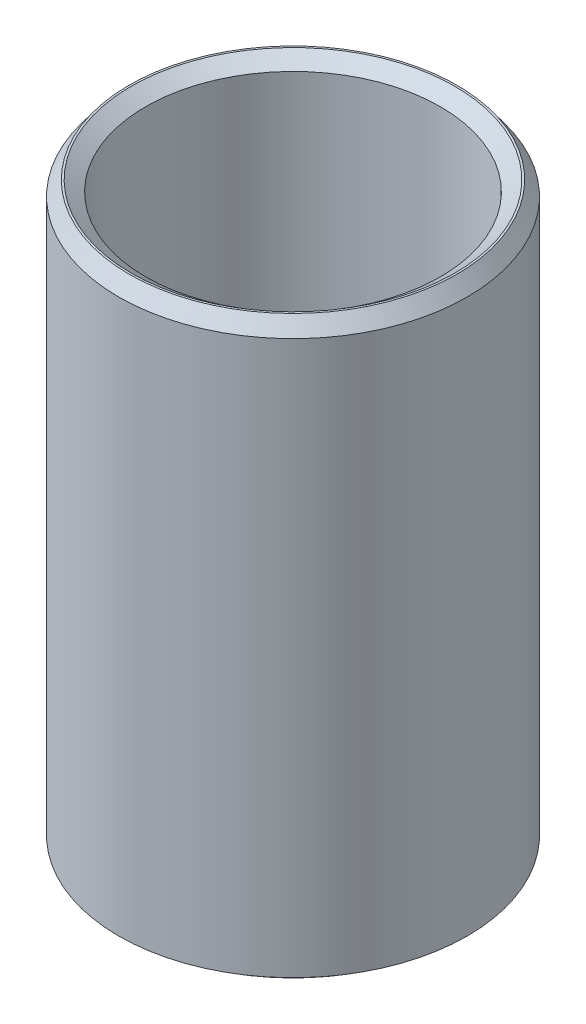
ISO-10303-21;
HEADER;
FILE_DESCRIPTION(('STEP AP214'),'2;1');
FILE_NAME('part.step','',(''),(''),'','','');
FILE_SCHEMA(('AUTOMOTIVE_DESIGN { 1 0 10303 214 1 1 1 1 }'));
ENDSEC;
DATA;
#1=APPLICATION_CONTEXT('core data for automotive mechanical design processes');
#2=APPLICATION_PROTOCOL_DEFINITION('international standard','automotive_design',2000,#1);
#3=PRODUCT_CONTEXT('',#1,'mechanical');
#4=PRODUCT('Part','Part','',(#3));
#5=PRODUCT_RELATED_PRODUCT_CATEGORY('part','',(#4));
#6=PRODUCT_DEFINITION_FORMATION('','',#4);
#7=PRODUCT_DEFINITION_CONTEXT('part definition',#1,'design');
#8=PRODUCT_DEFINITION('design','',#6,#7);
#9=PRODUCT_DEFINITION_SHAPE('','',#8);
#10=(LENGTH_UNIT() NAMED_UNIT(*) SI_UNIT(.MILLI.,.METRE.));
#11=(NAMED_UNIT(*) PLANE_ANGLE_UNIT() SI_UNIT($,.RADIAN.));
#12=(NAMED_UNIT(*) SI_UNIT($,.STERADIAN.) SOLID_ANGLE_UNIT());
#13=UNCERTAINTY_MEASURE_WITH_UNIT(LENGTH_MEASURE(1.E-05),#10,'distance_accuracy_value','');
#14=(GEOMETRIC_REPRESENTATION_CONTEXT(3) GLOBAL_UNCERTAINTY_ASSIGNED_CONTEXT((#13)) GLOBAL_UNIT_ASSIGNED_CONTEXT((#10,
#11,#12)) REPRESENTATION_CONTEXT('',''));
#15=CARTESIAN_POINT('',(0.,0.,0.));
#16=DIRECTION('',(0.,0.,1.));
#17=DIRECTION('',(1.,0.,0.));
#18=AXIS2_PLACEMENT_3D('',#15,#16,#17);
#19=CARTESIAN_POINT('',(0.,91.2519037499423,0.));
#20=DIRECTION('',(0.,-1.,0.));
#21=DIRECTION('',(0.,0.,-1.));
#22=AXIS2_PLACEMENT_3D('',#19,#20,#21);
#23=CYLINDRICAL_SURFACE('',#22,27.5);
#24=CARTESIAN_POINT('',(0.,1.64963419930186,0.));
#25=DIRECTION('',(0.,1.,0.));
#26=DIRECTION('',(0.,0.,1.));
#27=AXIS2_PLACEMENT_3D('',#24,#25,#26);
#28=CIRCLE('',#27,27.5);
#29=CARTESIAN_POINT('',(0.,1.64963419930186,27.5));
#30=VERTEX_POINT('',#29);
#31=EDGE_CURVE('E10',#30,#30,#28,.T.);
#32=ORIENTED_EDGE('',*,*,#31,.T.);
#33=EDGE_LOOP('',(#32));
#34=FACE_BOUND('',#33,.T.);
#35=CARTESIAN_POINT('',(0.,88.9726863714912,0.));
#36=DIRECTION('',(0.,1.,0.));
#37=DIRECTION('',(0.,0.,1.));
#38=AXIS2_PLACEMENT_3D('',#35,#36,#37);
#39=CIRCLE('',#38,27.5);
#40=CARTESIAN_POINT('',(0.,88.9726863714912,27.5));
#41=VERTEX_POINT('',#40);
#42=EDGE_CURVE('E50',#41,#41,#39,.F.);
#43=ORIENTED_EDGE('',*,*,#42,.T.);
#44=EDGE_LOOP('',(#43));
#45=FACE_BOUND('',#44,.T.);
#46=ADVANCED_FACE('F39',(#34,#45),#23,.T.);
#47=CARTESIAN_POINT('',(0.,91.2519037499423,0.));
#48=DIRECTION('',(0.,1.,0.));
#49=DIRECTION('',(0.,0.,1.));
#50=AXIS2_PLACEMENT_3D('',#47,#48,#49);
#51=PLANE('',#50);
#52=CARTESIAN_POINT('',(0.,91.2519037499423,0.));
#53=DIRECTION('',(0.,1.,0.));
#54=DIRECTION('',(0.,0.,1.));
#55=AXIS2_PLACEMENT_3D('',#52,#53,#54);
#56=CIRCLE('',#55,25.5357762547551);
#57=CARTESIAN_POINT('',(0.,91.2519037499423,25.5357762547551));
#58=VERTEX_POINT('',#57);
#59=EDGE_CURVE('E58',#58,#58,#56,.F.);
#60=ORIENTED_EDGE('',*,*,#59,.T.);
#61=EDGE_LOOP('',(#60));
#62=FACE_BOUND('',#61,.T.);
#63=CARTESIAN_POINT('',(0.,91.2519037499423,0.));
#64=DIRECTION('',(0.,1.,0.));
#65=DIRECTION('',(0.,0.,1.));
#66=AXIS2_PLACEMENT_3D('',#63,#64,#65);
#67=CIRCLE('',#66,25.8503658006982);
#68=CARTESIAN_POINT('',(0.,91.2519037499423,25.8503658006982));
#69=VERTEX_POINT('',#68);
#70=EDGE_CURVE('E61',#69,#69,#67,.T.);
#71=ORIENTED_EDGE('',*,*,#70,.T.);
#72=EDGE_LOOP('',(#71));
#73=FACE_BOUND('',#72,.T.);
#74=ADVANCED_FACE('F88',(#62,#73),#51,.T.);
#75=CARTESIAN_POINT('',(0.,0.,0.));
#76=DIRECTION('',(0.,1.,0.));
#77=DIRECTION('',(0.,0.,1.));
#78=AXIS2_PLACEMENT_3D('',#75,#76,#77);
#79=PLANE('',#78);
#80=CARTESIAN_POINT('',(0.,0.,0.));
#81=DIRECTION('',(0.,1.,0.));
#82=DIRECTION('',(0.,0.,1.));
#83=AXIS2_PLACEMENT_3D('',#80,#81,#82);
#84=CIRCLE('',#83,24.9061930756057);
#85=CARTESIAN_POINT('',(0.,0.,24.9061930756057));
#86=VERTEX_POINT('',#85);
#87=EDGE_CURVE('E51',#86,#86,#84,.T.);
#88=ORIENTED_EDGE('',*,*,#87,.T.);
#89=EDGE_LOOP('',(#88));
#90=FACE_BOUND('',#89,.T.);
#91=CARTESIAN_POINT('',(0.,0.,0.));
#92=DIRECTION('',(0.,1.,0.));
#93=DIRECTION('',(0.,0.,1.));
#94=AXIS2_PLACEMENT_3D('',#91,#92,#93);
#95=CIRCLE('',#94,25.2207826215488);
#96=CARTESIAN_POINT('',(0.,0.,25.2207826215488));
#97=VERTEX_POINT('',#96);
#98=EDGE_CURVE('E54',#97,#97,#95,.F.);
#99=ORIENTED_EDGE('',*,*,#98,.T.);
#100=EDGE_LOOP('',(#99));
#101=FACE_BOUND('',#100,.T.);
#102=ADVANCED_FACE('F83',(#90,#101),#79,.F.);
#103=CARTESIAN_POINT('',(0.,91.2519037499423,0.));
#104=DIRECTION('',(0.,-1.,0.));
#105=DIRECTION('',(0.,0.,-1.));
#106=AXIS2_PLACEMENT_3D('',#103,#104,#105);
#107=CYLINDRICAL_SURFACE('',#106,23.2565588763039);
#108=CARTESIAN_POINT('',(0.,89.6022695506405,0.));
#109=DIRECTION('',(0.,1.,0.));
#110=DIRECTION('',(0.,0.,1.));
#111=AXIS2_PLACEMENT_3D('',#108,#109,#110);
#112=CIRCLE('',#111,23.2565588763039);
#113=CARTESIAN_POINT('',(0.,89.6022695506405,23.2565588763039));
#114=VERTEX_POINT('',#113);
#115=EDGE_CURVE('E67',#114,#114,#112,.T.);
#116=ORIENTED_EDGE('',*,*,#115,.T.);
#117=EDGE_LOOP('',(#116));
#118=FACE_BOUND('',#117,.T.);
#119=CARTESIAN_POINT('',(0.,2.27921737845117,0.));
#120=DIRECTION('',(0.,1.,0.));
#121=DIRECTION('',(0.,0.,1.));
#122=AXIS2_PLACEMENT_3D('',#119,#120,#121);
#123=CIRCLE('',#122,23.2565588763039);
#124=CARTESIAN_POINT('',(0.,2.27921737845117,23.2565588763039));
#125=VERTEX_POINT('',#124);
#126=EDGE_CURVE('E69',#125,#125,#123,.F.);
#127=ORIENTED_EDGE('',*,*,#126,.T.);
#128=EDGE_LOOP('',(#127));
#129=FACE_BOUND('',#128,.T.);
#130=ADVANCED_FACE('F71',(#118,#129),#107,.F.);
#131=CARTESIAN_POINT('',(0.,89.6022695506405,0.));
#132=DIRECTION('',(0.,1.,0.));
#133=DIRECTION('',(0.,0.,1.));
#134=AXIS2_PLACEMENT_3D('',#131,#132,#133);
#135=CONICAL_SURFACE('',#134,23.2565588763039,0.944293382482027);
#136=ORIENTED_EDGE('',*,*,#59,.F.);
#137=EDGE_LOOP('',(#136));
#138=FACE_BOUND('',#137,.T.);
#139=ORIENTED_EDGE('',*,*,#115,.F.);
#140=EDGE_LOOP('',(#139));
#141=FACE_BOUND('',#140,.T.);
#142=ADVANCED_FACE('F77',(#138,#141),#135,.F.);
#143=CARTESIAN_POINT('',(0.,0.,0.));
#144=DIRECTION('',(0.,-1.,0.));
#145=DIRECTION('',(0.,0.,-1.));
#146=AXIS2_PLACEMENT_3D('',#143,#144,#145);
#147=CONICAL_SURFACE('',#146,24.9061930756057,0.626502944312873);
#148=ORIENTED_EDGE('',*,*,#126,.F.);
#149=EDGE_LOOP('',(#148));
#150=FACE_BOUND('',#149,.T.);
#151=ORIENTED_EDGE('',*,*,#87,.F.);
#152=EDGE_LOOP('',(#151));
#153=FACE_BOUND('',#152,.T.);
#154=ADVANCED_FACE('F73',(#150,#153),#147,.F.);
#155=CARTESIAN_POINT('',(0.,1.64963419930186,0.));
#156=DIRECTION('',(0.,1.,0.));
#157=DIRECTION('',(0.,0.,1.));
#158=AXIS2_PLACEMENT_3D('',#155,#156,#157);
#159=CONICAL_SURFACE('',#158,27.5,0.944293382482025);
#160=ORIENTED_EDGE('',*,*,#98,.F.);
#161=EDGE_LOOP('',(#160));
#162=FACE_BOUND('',#161,.T.);
#163=ORIENTED_EDGE('',*,*,#31,.F.);
#164=EDGE_LOOP('',(#163));
#165=FACE_BOUND('',#164,.T.);
#166=ADVANCED_FACE('F76',(#162,#165),#159,.T.);
#167=CARTESIAN_POINT('',(0.,91.2519037499423,0.));
#168=DIRECTION('',(0.,-1.,0.));
#169=DIRECTION('',(0.,0.,-1.));
#170=AXIS2_PLACEMENT_3D('',#167,#168,#169);
#171=CONICAL_SURFACE('',#170,25.8503658006982,0.62650294431287);
#172=ORIENTED_EDGE('',*,*,#42,.F.);
#173=EDGE_LOOP('',(#172));
#174=FACE_BOUND('',#173,.T.);
#175=ORIENTED_EDGE('',*,*,#70,.F.);
#176=EDGE_LOOP('',(#175));
#177=FACE_BOUND('',#176,.T.);
#178=ADVANCED_FACE('F45',(#174,#177),#171,.T.);
#179=CLOSED_SHELL('',(#46,#74,#102,#130,#142,#154,#166,#178));
#180=MANIFOLD_SOLID_BREP('B2',#179);
#181=ADVANCED_BREP_SHAPE_REPRESENTATION('',(#18,#180),#14);
#182=SHAPE_DEFINITION_REPRESENTATION(#9,#181);
ENDSEC;
END-ISO-10303-21;
